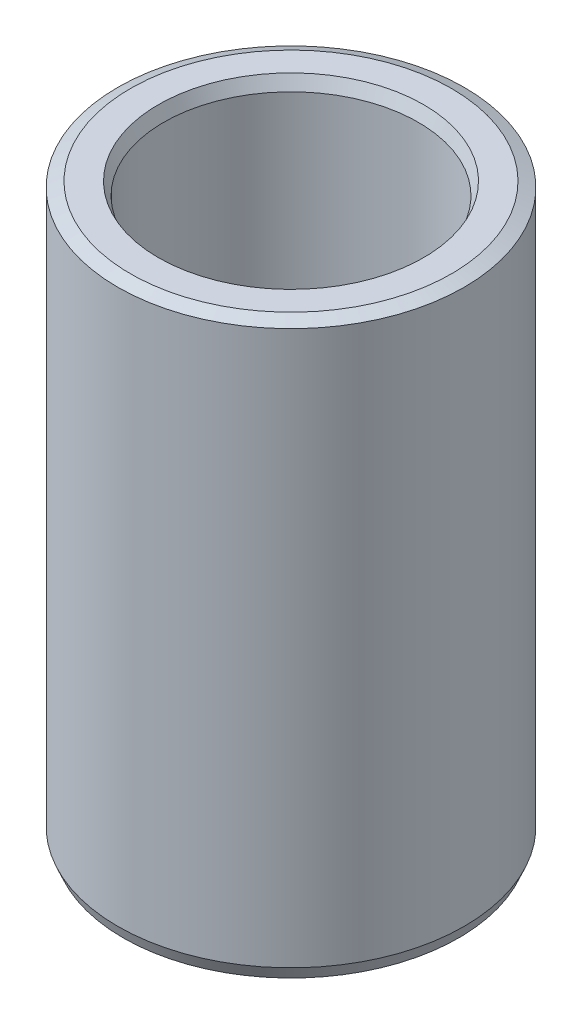
ISO-10303-21;
HEADER;
FILE_DESCRIPTION(('STEP AP214'),'2;1');
FILE_NAME('part.step','',(''),(''),'','','');
FILE_SCHEMA(('AUTOMOTIVE_DESIGN { 1 0 10303 214 1 1 1 1 }'));
ENDSEC;
DATA;
#1=APPLICATION_CONTEXT('core data for automotive mechanical design processes');
#2=APPLICATION_PROTOCOL_DEFINITION('international standard','automotive_design',2000,#1);
#3=PRODUCT_CONTEXT('',#1,'mechanical');
#4=PRODUCT('Part','Part','',(#3));
#5=PRODUCT_RELATED_PRODUCT_CATEGORY('part','',(#4));
#6=PRODUCT_DEFINITION_FORMATION('','',#4);
#7=PRODUCT_DEFINITION_CONTEXT('part definition',#1,'design');
#8=PRODUCT_DEFINITION('design','',#6,#7);
#9=PRODUCT_DEFINITION_SHAPE('','',#8);
#10=(LENGTH_UNIT() NAMED_UNIT(*) SI_UNIT(.MILLI.,.METRE.));
#11=(NAMED_UNIT(*) PLANE_ANGLE_UNIT() SI_UNIT($,.RADIAN.));
#12=(NAMED_UNIT(*) SI_UNIT($,.STERADIAN.) SOLID_ANGLE_UNIT());
#13=UNCERTAINTY_MEASURE_WITH_UNIT(LENGTH_MEASURE(1.E-05),#10,'distance_accuracy_value','');
#14=(GEOMETRIC_REPRESENTATION_CONTEXT(3) GLOBAL_UNCERTAINTY_ASSIGNED_CONTEXT((#13)) GLOBAL_UNIT_ASSIGNED_CONTEXT((#10,
#11,#12)) REPRESENTATION_CONTEXT('',''));
#15=CARTESIAN_POINT('',(0.,0.,0.));
#16=DIRECTION('',(0.,0.,1.));
#17=DIRECTION('',(1.,0.,0.));
#18=AXIS2_PLACEMENT_3D('',#15,#16,#17);
#19=CARTESIAN_POINT('',(0.,181.490845620147,0.));
#20=DIRECTION('',(0.,-1.,0.));
#21=DIRECTION('',(0.,0.,-1.));
#22=AXIS2_PLACEMENT_3D('',#19,#20,#21);
#23=CYLINDRICAL_SURFACE('',#22,55.);
#24=CARTESIAN_POINT('',(0.,4.01554123788345,0.));
#25=DIRECTION('',(0.,1.,0.));
#26=DIRECTION('',(0.,0.,1.));
#27=AXIS2_PLACEMENT_3D('',#24,#25,#26);
#28=CIRCLE('',#27,55.);
#29=CARTESIAN_POINT('',(0.,4.01554123788345,55.));
#30=VERTEX_POINT('',#29);
#31=EDGE_CURVE('E10',#30,#30,#28,.T.);
#32=ORIENTED_EDGE('',*,*,#31,.T.);
#33=EDGE_LOOP('',(#32));
#34=FACE_BOUND('',#33,.T.);
#35=CARTESIAN_POINT('',(0.,179.801636369817,0.));
#36=DIRECTION('',(0.,1.,0.));
#37=DIRECTION('',(0.,0.,1.));
#38=AXIS2_PLACEMENT_3D('',#35,#36,#37);
#39=CIRCLE('',#38,55.);
#40=CARTESIAN_POINT('',(0.,179.801636369817,-55.));
#41=VERTEX_POINT('',#40);
#42=EDGE_CURVE('E50',#41,#41,#39,.F.);
#43=ORIENTED_EDGE('',*,*,#42,.T.);
#44=EDGE_LOOP('',(#43));
#45=FACE_BOUND('',#44,.T.);
#46=ADVANCED_FACE('F39',(#34,#45),#23,.T.);
#47=CARTESIAN_POINT('',(0.,181.490845620147,0.));
#48=DIRECTION('',(0.,1.,0.));
#49=DIRECTION('',(0.,0.,1.));
#50=AXIS2_PLACEMENT_3D('',#47,#48,#49);
#51=PLANE('',#50);
#52=CARTESIAN_POINT('',(0.,181.490845620147,0.));
#53=DIRECTION('',(0.,1.,0.));
#54=DIRECTION('',(0.,0.,1.));
#55=AXIS2_PLACEMENT_3D('',#52,#53,#54);
#56=CIRCLE('',#55,42.1145372887681);
#57=CARTESIAN_POINT('',(0.,181.490845620147,42.1145372887681));
#58=VERTEX_POINT('',#57);
#59=EDGE_CURVE('E58',#58,#58,#56,.F.);
#60=ORIENTED_EDGE('',*,*,#59,.T.);
#61=EDGE_LOOP('',(#60));
#62=FACE_BOUND('',#61,.T.);
#63=CARTESIAN_POINT('',(0.,181.490845620147,0.));
#64=DIRECTION('',(0.,1.,0.));
#65=DIRECTION('',(0.,0.,1.));
#66=AXIS2_PLACEMENT_3D('',#63,#64,#65);
#67=CIRCLE('',#66,50.9844587621164);
#68=CARTESIAN_POINT('',(0.,181.490845620146,-50.9844587621165));
#69=VERTEX_POINT('',#68);
#70=EDGE_CURVE('E61',#69,#69,#67,.T.);
#71=ORIENTED_EDGE('',*,*,#70,.T.);
#72=EDGE_LOOP('',(#71));
#73=FACE_BOUND('',#72,.T.);
#74=ADVANCED_FACE('F88',(#62,#73),#51,.T.);
#75=CARTESIAN_POINT('',(0.,0.,0.));
#76=DIRECTION('',(0.,1.,0.));
#77=DIRECTION('',(0.,0.,1.));
#78=AXIS2_PLACEMENT_3D('',#75,#76,#77);
#79=PLANE('',#78);
#80=CARTESIAN_POINT('',(0.,0.,0.));
#81=DIRECTION('',(0.,1.,0.));
#82=DIRECTION('',(0.,0.,1.));
#83=AXIS2_PLACEMENT_3D('',#80,#81,#82);
#84=CIRCLE('',#83,44.440869276322);
#85=CARTESIAN_POINT('',(0.,0.,44.440869276322));
#86=VERTEX_POINT('',#85);
#87=EDGE_CURVE('E51',#86,#86,#84,.T.);
#88=ORIENTED_EDGE('',*,*,#87,.T.);
#89=EDGE_LOOP('',(#88));
#90=FACE_BOUND('',#89,.T.);
#91=CARTESIAN_POINT('',(0.,0.,0.));
#92=DIRECTION('',(0.,1.,0.));
#93=DIRECTION('',(0.,0.,1.));
#94=AXIS2_PLACEMENT_3D('',#91,#92,#93);
#95=CIRCLE('',#94,53.3107907496705);
#96=CARTESIAN_POINT('',(0.,0.,53.3107907496705));
#97=VERTEX_POINT('',#96);
#98=EDGE_CURVE('E54',#97,#97,#95,.F.);
#99=ORIENTED_EDGE('',*,*,#98,.T.);
#100=EDGE_LOOP('',(#99));
#101=FACE_BOUND('',#100,.T.);
#102=ADVANCED_FACE('F83',(#90,#101),#79,.F.);
#103=CARTESIAN_POINT('',(0.,181.490845620147,0.));
#104=DIRECTION('',(0.,-1.,0.));
#105=DIRECTION('',(0.,0.,-1.));
#106=AXIS2_PLACEMENT_3D('',#103,#104,#105);
#107=CYLINDRICAL_SURFACE('',#106,40.4253280384386);
#108=CARTESIAN_POINT('',(0.,177.475304382263,0.));
#109=DIRECTION('',(0.,1.,0.));
#110=DIRECTION('',(0.,0.,1.));
#111=AXIS2_PLACEMENT_3D('',#108,#109,#110);
#112=CIRCLE('',#111,40.4253280384386);
#113=CARTESIAN_POINT('',(0.,177.475304382263,40.4253280384386));
#114=VERTEX_POINT('',#113);
#115=EDGE_CURVE('E67',#114,#114,#112,.T.);
#116=ORIENTED_EDGE('',*,*,#115,.T.);
#117=EDGE_LOOP('',(#116));
#118=FACE_BOUND('',#117,.T.);
#119=CARTESIAN_POINT('',(0.,1.68920925032953,0.));
#120=DIRECTION('',(0.,1.,0.));
#121=DIRECTION('',(0.,0.,1.));
#122=AXIS2_PLACEMENT_3D('',#119,#120,#121);
#123=CIRCLE('',#122,40.4253280384386);
#124=CARTESIAN_POINT('',(0.,1.68920925032953,40.4253280384386));
#125=VERTEX_POINT('',#124);
#126=EDGE_CURVE('E69',#125,#125,#123,.F.);
#127=ORIENTED_EDGE('',*,*,#126,.T.);
#128=EDGE_LOOP('',(#127));
#129=FACE_BOUND('',#128,.T.);
#130=ADVANCED_FACE('F71',(#118,#129),#107,.F.);
#131=CARTESIAN_POINT('',(0.,177.475304382263,0.));
#132=DIRECTION('',(0.,1.,0.));
#133=DIRECTION('',(0.,0.,1.));
#134=AXIS2_PLACEMENT_3D('',#131,#132,#133);
#135=CONICAL_SURFACE('',#134,40.4253280384386,0.398195594686611);
#136=ORIENTED_EDGE('',*,*,#59,.F.);
#137=EDGE_LOOP('',(#136));
#138=FACE_BOUND('',#137,.T.);
#139=ORIENTED_EDGE('',*,*,#115,.F.);
#140=EDGE_LOOP('',(#139));
#141=FACE_BOUND('',#140,.T.);
#142=ADVANCED_FACE('F77',(#138,#141),#135,.F.);
#143=CARTESIAN_POINT('',(0.,0.,0.));
#144=DIRECTION('',(0.,-1.,0.));
#145=DIRECTION('',(0.,0.,-1.));
#146=AXIS2_PLACEMENT_3D('',#143,#144,#145);
#147=CONICAL_SURFACE('',#146,44.440869276322,1.17260073210828);
#148=ORIENTED_EDGE('',*,*,#126,.F.);
#149=EDGE_LOOP('',(#148));
#150=FACE_BOUND('',#149,.T.);
#151=ORIENTED_EDGE('',*,*,#87,.F.);
#152=EDGE_LOOP('',(#151));
#153=FACE_BOUND('',#152,.T.);
#154=ADVANCED_FACE('F73',(#150,#153),#147,.F.);
#155=CARTESIAN_POINT('',(0.,4.01554123788345,0.));
#156=DIRECTION('',(0.,1.,0.));
#157=DIRECTION('',(0.,0.,1.));
#158=AXIS2_PLACEMENT_3D('',#155,#156,#157);
#159=CONICAL_SURFACE('',#158,55.,0.398195594686616);
#160=ORIENTED_EDGE('',*,*,#98,.F.);
#161=EDGE_LOOP('',(#160));
#162=FACE_BOUND('',#161,.T.);
#163=ORIENTED_EDGE('',*,*,#31,.F.);
#164=EDGE_LOOP('',(#163));
#165=FACE_BOUND('',#164,.T.);
#166=ADVANCED_FACE('F76',(#162,#165),#159,.T.);
#167=CARTESIAN_POINT('',(0.,181.490845620147,0.));
#168=DIRECTION('',(0.,-1.,0.));
#169=DIRECTION('',(0.,0.,-1.));
#170=AXIS2_PLACEMENT_3D('',#167,#168,#169);
#171=CONICAL_SURFACE('',#170,50.9844587621164,1.17260073210828);
#172=CARTESIAN_POINT('',(0.,179.801636369817,-55.));
#173=CARTESIAN_POINT('',(0.,179.819232299508,-54.9581714454388));
#174=CARTESIAN_POINT('',(0.,179.836828229199,-54.9163428908775));
#175=CARTESIAN_POINT('',(0.,179.872020088581,-54.8326857817549));
#176=CARTESIAN_POINT('',(0.,179.889616018272,-54.7908572271936));
#177=CARTESIAN_POINT('',(0.,179.924807877653,-54.707200118071));
#178=CARTESIAN_POINT('',(0.,179.942403807344,-54.6653715635097));
#179=CARTESIAN_POINT('',(0.,179.977595666726,-54.5817144543872));
#180=CARTESIAN_POINT('',(0.,179.995191596417,-54.5398858998259));
#181=CARTESIAN_POINT('',(0.,180.030383455799,-54.4562287907033));
#182=CARTESIAN_POINT('',(0.,180.04797938549,-54.414400236142));
#183=CARTESIAN_POINT('',(0.,180.083171244872,-54.3307431270194));
#184=CARTESIAN_POINT('',(0.,180.100767174563,-54.2889145724582));
#185=CARTESIAN_POINT('',(0.,180.135959033945,-54.2052574633356));
#186=CARTESIAN_POINT('',(0.,180.153554963636,-54.1634289087743));
#187=CARTESIAN_POINT('',(0.,180.188746823017,-54.0797717996517));
#188=CARTESIAN_POINT('',(0.,180.206342752708,-54.0379432450904));
#189=CARTESIAN_POINT('',(0.,180.24153461209,-53.9542861359679));
#190=CARTESIAN_POINT('',(0.,180.259130541781,-53.9124575814066));
#191=CARTESIAN_POINT('',(0.,180.294322401163,-53.828800472284));
#192=CARTESIAN_POINT('',(0.,180.311918330854,-53.7869719177227));
#193=CARTESIAN_POINT('',(0.,180.347110190236,-53.7033148086001));
#194=CARTESIAN_POINT('',(0.,180.364706119927,-53.6614862540388));
#195=CARTESIAN_POINT('',(0.,180.399897979309,-53.5778291449163));
#196=CARTESIAN_POINT('',(0.,180.417493909,-53.536000590355));
#197=CARTESIAN_POINT('',(0.,180.452685768381,-53.4523434812324));
#198=CARTESIAN_POINT('',(0.,180.470281698072,-53.4105149266711));
#199=CARTESIAN_POINT('',(0.,180.505473557454,-53.3268578175486));
#200=CARTESIAN_POINT('',(0.,180.523069487145,-53.2850292629873));
#201=CARTESIAN_POINT('',(0.,180.558261346527,-53.2013721538647));
#202=CARTESIAN_POINT('',(0.,180.575857276218,-53.1595435993034));
#203=CARTESIAN_POINT('',(0.,180.6110491356,-53.0758864901808));
#204=CARTESIAN_POINT('',(0.,180.628645065291,-53.0340579356195));
#205=CARTESIAN_POINT('',(0.,180.663836924673,-52.950400826497));
#206=CARTESIAN_POINT('',(0.,180.681432854364,-52.9085722719357));
#207=CARTESIAN_POINT('',(0.,180.716624713745,-52.8249151628131));
#208=CARTESIAN_POINT('',(0.,180.734220643436,-52.7830866082518));
#209=CARTESIAN_POINT('',(0.,180.769412502818,-52.6994294991292));
#210=CARTESIAN_POINT('',(0.,180.787008432509,-52.657600944568));
#211=CARTESIAN_POINT('',(0.,180.822200291891,-52.5739438354454));
#212=CARTESIAN_POINT('',(0.,180.839796221582,-52.5321152808841));
#213=CARTESIAN_POINT('',(0.,180.874988080964,-52.4484581717615));
#214=CARTESIAN_POINT('',(0.,180.892584010655,-52.4066296172002));
#215=CARTESIAN_POINT('',(0.,180.927775870037,-52.3229725080777));
#216=CARTESIAN_POINT('',(0.,180.945371799728,-52.2811439535164));
#217=CARTESIAN_POINT('',(0.,180.980563659109,-52.1974868443938));
#218=CARTESIAN_POINT('',(0.,180.9981595888,-52.1556582898325));
#219=CARTESIAN_POINT('',(0.,181.033351448182,-52.0720011807099));
#220=CARTESIAN_POINT('',(0.,181.050947377873,-52.0301726261486));
#221=CARTESIAN_POINT('',(0.,181.086139237255,-51.9465155170261));
#222=CARTESIAN_POINT('',(0.,181.103735166946,-51.9046869624648));
#223=CARTESIAN_POINT('',(0.,181.138927026328,-51.8210298533422));
#224=CARTESIAN_POINT('',(0.,181.156522956019,-51.7792012987809));
#225=CARTESIAN_POINT('',(0.,181.191714815401,-51.6955441896583));
#226=CARTESIAN_POINT('',(0.,181.209310745092,-51.6537156350971));
#227=CARTESIAN_POINT('',(0.,181.244502604473,-51.5700585259745));
#228=CARTESIAN_POINT('',(0.,181.262098534164,-51.5282299714132));
#229=CARTESIAN_POINT('',(0.,181.297290393546,-51.4445728622906));
#230=CARTESIAN_POINT('',(0.,181.314886323237,-51.4027443077293));
#231=CARTESIAN_POINT('',(0.,181.350078182619,-51.3190871986068));
#232=CARTESIAN_POINT('',(0.,181.36767411231,-51.2772586440455));
#233=CARTESIAN_POINT('',(0.,181.402865971692,-51.1936015349229));
#234=CARTESIAN_POINT('',(0.,181.420461901383,-51.1517729803616));
#235=CARTESIAN_POINT('',(0.,181.455653760765,-51.068115871239));
#236=CARTESIAN_POINT('',(0.,181.473249690456,-51.0262873166778));
#237=CARTESIAN_POINT('',(0.,181.490845620147,-50.9844587621165));
#238=B_SPLINE_CURVE_WITH_KNOTS('',3,(#172,#173,#174,#175,#176,#177,#178,#179,#180,#181,#182,
#183,#184,#185,#186,#187,#188,#189,#190,#191,#192,#193,#194,#195,#196,#197,#198,#199,#200,#201,
#202,#203,#204,#205,#206,#207,#208,#209,#210,#211,#212,#213,#214,#215,#216,#217,#218,#219,#220,
#221,#222,#223,#224,#225,#226,#227,#228,#229,#230,#231,#232,#233,#234,#235,#236,#237),
.UNSPECIFIED.,.F.,.F.,(4,2,2,2,2,2,2,2,2,2,2,2,2,2,2,2,2,2,2,2,2,2,2,2,2,2,2,2,2,2,2,2,4),(0.,
0.136136705062866,0.272273410125738,0.408410115188604,0.544546820251459,0.680683525314324,
0.816820230377197,0.952956935440062,1.08909364050292,1.22523034556579,1.36136705062866,
1.49750375569152,1.63364046075438,1.76977716581725,1.90591387088011,2.04205057594298,
2.17818728100584,2.31432398606871,2.45046069113157,2.58659739619444,2.7227341012573,
2.85887080632017,2.99500751138303,3.1311442164459,3.26728092150877,3.40341762657162,
3.5395543316345,3.67569103669736,3.81182774176023,3.94796444682308,4.08410115188595,
4.22023785694882,4.35637456201169),.UNSPECIFIED.);
#239=EDGE_CURVE('BSEAM45',#41,#69,#238,.T.);
#240=ORIENTED_EDGE('',*,*,#42,.F.);
#241=ORIENTED_EDGE('',*,*,#70,.F.);
#242=ORIENTED_EDGE('',*,*,#239,.T.);
#243=ORIENTED_EDGE('',*,*,#239,.F.);
#244=EDGE_LOOP('',(#240,#242,#241,#243));
#245=FACE_BOUND('',#244,.T.);
#246=ADVANCED_FACE('F45',(#245),#171,.T.);
#247=CLOSED_SHELL('',(#46,#74,#102,#130,#142,#154,#166,#246));
#248=MANIFOLD_SOLID_BREP('B2',#247);
#249=ADVANCED_BREP_SHAPE_REPRESENTATION('',(#18,#248),#14);
#250=SHAPE_DEFINITION_REPRESENTATION(#9,#249);
ENDSEC;
END-ISO-10303-21;
